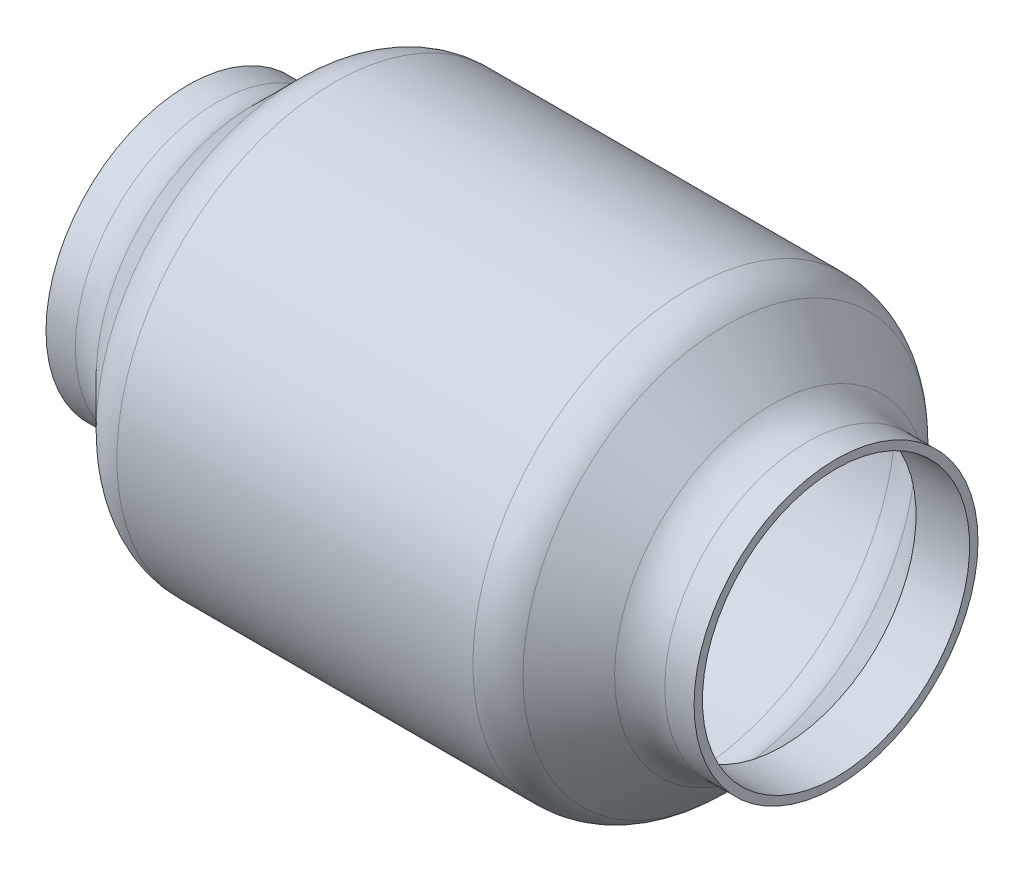
ISO-10303-21;
HEADER;
FILE_DESCRIPTION(('STEP AP214'),'2;1');
FILE_NAME('part.step','',(''),(''),'','','');
FILE_SCHEMA(('AUTOMOTIVE_DESIGN { 1 0 10303 214 1 1 1 1 }'));
ENDSEC;
DATA;
#1=APPLICATION_CONTEXT('core data for automotive mechanical design processes');
#2=APPLICATION_PROTOCOL_DEFINITION('international standard','automotive_design',2000,#1);
#3=PRODUCT_CONTEXT('',#1,'mechanical');
#4=PRODUCT('Part','Part','',(#3));
#5=PRODUCT_RELATED_PRODUCT_CATEGORY('part','',(#4));
#6=PRODUCT_DEFINITION_FORMATION('','',#4);
#7=PRODUCT_DEFINITION_CONTEXT('part definition',#1,'design');
#8=PRODUCT_DEFINITION('design','',#6,#7);
#9=PRODUCT_DEFINITION_SHAPE('','',#8);
#10=(LENGTH_UNIT() NAMED_UNIT(*) SI_UNIT(.MILLI.,.METRE.));
#11=(NAMED_UNIT(*) PLANE_ANGLE_UNIT() SI_UNIT($,.RADIAN.));
#12=(NAMED_UNIT(*) SI_UNIT($,.STERADIAN.) SOLID_ANGLE_UNIT());
#13=UNCERTAINTY_MEASURE_WITH_UNIT(LENGTH_MEASURE(1.E-05),#10,'distance_accuracy_value','');
#14=(GEOMETRIC_REPRESENTATION_CONTEXT(3) GLOBAL_UNCERTAINTY_ASSIGNED_CONTEXT((#13)) GLOBAL_UNIT_ASSIGNED_CONTEXT((#10,
#11,#12)) REPRESENTATION_CONTEXT('',''));
#15=CARTESIAN_POINT('',(0.,0.,0.));
#16=DIRECTION('',(0.,0.,1.));
#17=DIRECTION('',(1.,0.,0.));
#18=AXIS2_PLACEMENT_3D('',#15,#16,#17);
#19=CARTESIAN_POINT('',(-123.19,0.,0.));
#20=DIRECTION('',(-1.,0.,0.));
#21=DIRECTION('',(0.,-1.,0.));
#22=AXIS2_PLACEMENT_3D('',#19,#20,#21);
#23=CYLINDRICAL_SURFACE('',#22,50.8);
#24=CARTESIAN_POINT('',(-102.824871939465,0.,0.));
#25=DIRECTION('',(-1.,0.,0.));
#26=DIRECTION('',(0.,-1.,0.));
#27=AXIS2_PLACEMENT_3D('',#24,#25,#26);
#28=CIRCLE('',#27,50.8);
#29=CARTESIAN_POINT('',(-102.824871939465,-50.8,0.));
#30=VERTEX_POINT('',#29);
#31=EDGE_CURVE('E10',#30,#30,#28,.T.);
#32=ORIENTED_EDGE('',*,*,#31,.F.);
#33=EDGE_LOOP('',(#32));
#34=FACE_BOUND('',#33,.T.);
#35=CARTESIAN_POINT('',(-123.19,0.,0.));
#36=DIRECTION('',(-1.,0.,0.));
#37=DIRECTION('',(0.,-1.,0.));
#38=AXIS2_PLACEMENT_3D('',#35,#36,#37);
#39=CIRCLE('',#38,50.8);
#40=CARTESIAN_POINT('',(-123.19,-50.8,0.));
#41=VERTEX_POINT('',#40);
#42=EDGE_CURVE('E91',#41,#41,#39,.T.);
#43=ORIENTED_EDGE('',*,*,#42,.T.);
#44=EDGE_LOOP('',(#43));
#45=FACE_BOUND('',#44,.T.);
#46=ADVANCED_FACE('F33',(#34,#45),#23,.F.);
#47=CARTESIAN_POINT('',(-102.824871939465,0.,0.));
#48=DIRECTION('',(1.,0.,0.));
#49=DIRECTION('',(0.,1.,0.));
#50=AXIS2_PLACEMENT_3D('',#47,#48,#49);
#51=CONICAL_SURFACE('',#50,50.8,0.78539816339745);
#52=CARTESIAN_POINT('',(-79.8294877578618,0.,0.));
#53=DIRECTION('',(-1.,0.,0.));
#54=DIRECTION('',(0.,-1.,0.));
#55=AXIS2_PLACEMENT_3D('',#52,#53,#54);
#56=CIRCLE('',#55,73.7953841816037);
#57=CARTESIAN_POINT('',(-79.8294877578618,-73.7953841816037,0.));
#58=VERTEX_POINT('',#57);
#59=EDGE_CURVE('E39',#58,#58,#56,.T.);
#60=ORIENTED_EDGE('',*,*,#59,.F.);
#61=EDGE_LOOP('',(#60));
#62=FACE_BOUND('',#61,.T.);
#63=ORIENTED_EDGE('',*,*,#31,.T.);
#64=EDGE_LOOP('',(#63));
#65=FACE_BOUND('',#64,.T.);
#66=ADVANCED_FACE('F188',(#62,#65),#51,.F.);
#67=CARTESIAN_POINT('',(-66.3591035762581,0.,0.));
#68=DIRECTION('',(-1.,0.,0.));
#69=DIRECTION('',(0.,-1.,0.));
#70=AXIS2_PLACEMENT_3D('',#67,#68,#69);
#71=TOROIDAL_SURFACE('',#70,60.325,19.05);
#72=CARTESIAN_POINT('',(-66.3591035762581,0.,0.));
#73=DIRECTION('',(-1.,0.,0.));
#74=DIRECTION('',(0.,-1.,0.));
#75=AXIS2_PLACEMENT_3D('',#72,#73,#74);
#76=CIRCLE('',#75,79.375);
#77=CARTESIAN_POINT('',(-66.359103576258,-79.375,0.));
#78=VERTEX_POINT('',#77);
#79=EDGE_CURVE('E43',#78,#78,#76,.T.);
#80=ORIENTED_EDGE('',*,*,#79,.F.);
#81=EDGE_LOOP('',(#80));
#82=FACE_BOUND('',#81,.T.);
#83=ORIENTED_EDGE('',*,*,#59,.T.);
#84=EDGE_LOOP('',(#83));
#85=FACE_BOUND('',#84,.T.);
#86=ADVANCED_FACE('F183',(#82,#85),#71,.F.);
#87=CARTESIAN_POINT('',(-123.19,0.,0.));
#88=DIRECTION('',(-1.,0.,0.));
#89=DIRECTION('',(0.,-1.,0.));
#90=AXIS2_PLACEMENT_3D('',#87,#88,#89);
#91=CYLINDRICAL_SURFACE('',#90,79.375);
#92=CARTESIAN_POINT('',(66.3591035762581,0.,0.));
#93=DIRECTION('',(-1.,0.,0.));
#94=DIRECTION('',(0.,-1.,0.));
#95=AXIS2_PLACEMENT_3D('',#92,#93,#94);
#96=CIRCLE('',#95,79.3749999999999);
#97=CARTESIAN_POINT('',(66.3591035762581,-79.3749999999999,0.));
#98=VERTEX_POINT('',#97);
#99=EDGE_CURVE('E47',#98,#98,#96,.T.);
#100=ORIENTED_EDGE('',*,*,#99,.F.);
#101=EDGE_LOOP('',(#100));
#102=FACE_BOUND('',#101,.T.);
#103=ORIENTED_EDGE('',*,*,#79,.T.);
#104=EDGE_LOOP('',(#103));
#105=FACE_BOUND('',#104,.T.);
#106=ADVANCED_FACE('F177',(#102,#105),#91,.F.);
#107=CARTESIAN_POINT('',(66.3591035762581,0.,0.));
#108=DIRECTION('',(-1.,0.,0.));
#109=DIRECTION('',(0.,-1.,0.));
#110=AXIS2_PLACEMENT_3D('',#107,#108,#109);
#111=TOROIDAL_SURFACE('',#110,60.3249999999999,19.05);
#112=CARTESIAN_POINT('',(79.8294877578618,0.,0.));
#113=DIRECTION('',(-1.,0.,0.));
#114=DIRECTION('',(0.,-1.,0.));
#115=AXIS2_PLACEMENT_3D('',#112,#113,#114);
#116=CIRCLE('',#115,73.7953841816036);
#117=CARTESIAN_POINT('',(79.8294877578618,-73.7953841816036,0.));
#118=VERTEX_POINT('',#117);
#119=EDGE_CURVE('E52',#118,#118,#116,.T.);
#120=ORIENTED_EDGE('',*,*,#119,.F.);
#121=EDGE_LOOP('',(#120));
#122=FACE_BOUND('',#121,.T.);
#123=ORIENTED_EDGE('',*,*,#99,.T.);
#124=EDGE_LOOP('',(#123));
#125=FACE_BOUND('',#124,.T.);
#126=ADVANCED_FACE('F171',(#122,#125),#111,.F.);
#127=CARTESIAN_POINT('',(79.8294877578618,0.,0.));
#128=DIRECTION('',(-1.,0.,0.));
#129=DIRECTION('',(0.,-1.,0.));
#130=AXIS2_PLACEMENT_3D('',#127,#128,#129);
#131=CONICAL_SURFACE('',#130,73.7953841816036,0.78539816339745);
#132=CARTESIAN_POINT('',(102.824871939465,0.,0.));
#133=DIRECTION('',(-1.,0.,0.));
#134=DIRECTION('',(0.,-1.,0.));
#135=AXIS2_PLACEMENT_3D('',#132,#133,#134);
#136=CIRCLE('',#135,50.7999999999999);
#137=CARTESIAN_POINT('',(102.824871939465,-50.7999999999999,0.));
#138=VERTEX_POINT('',#137);
#139=EDGE_CURVE('E55',#138,#138,#136,.T.);
#140=ORIENTED_EDGE('',*,*,#139,.F.);
#141=EDGE_LOOP('',(#140));
#142=FACE_BOUND('',#141,.T.);
#143=ORIENTED_EDGE('',*,*,#119,.T.);
#144=EDGE_LOOP('',(#143));
#145=FACE_BOUND('',#144,.T.);
#146=ADVANCED_FACE('F165',(#142,#145),#131,.F.);
#147=CARTESIAN_POINT('',(-123.19,0.,0.));
#148=DIRECTION('',(-1.,0.,0.));
#149=DIRECTION('',(0.,-1.,0.));
#150=AXIS2_PLACEMENT_3D('',#147,#148,#149);
#151=CYLINDRICAL_SURFACE('',#150,50.7999999999999);
#152=CARTESIAN_POINT('',(123.19,0.,0.));
#153=DIRECTION('',(-1.,0.,0.));
#154=DIRECTION('',(0.,-1.,0.));
#155=AXIS2_PLACEMENT_3D('',#152,#153,#154);
#156=CIRCLE('',#155,50.7999999999999);
#157=CARTESIAN_POINT('',(123.19,-50.7999999999999,0.));
#158=VERTEX_POINT('',#157);
#159=EDGE_CURVE('E58',#158,#158,#156,.T.);
#160=ORIENTED_EDGE('',*,*,#159,.F.);
#161=EDGE_LOOP('',(#160));
#162=FACE_BOUND('',#161,.T.);
#163=ORIENTED_EDGE('',*,*,#139,.T.);
#164=EDGE_LOOP('',(#163));
#165=FACE_BOUND('',#164,.T.);
#166=ADVANCED_FACE('F159',(#162,#165),#151,.F.);
#167=CARTESIAN_POINT('',(123.19,50.8,0.));
#168=DIRECTION('',(-1.,0.,0.));
#169=DIRECTION('',(0.,-1.,0.));
#170=AXIS2_PLACEMENT_3D('',#167,#168,#169);
#171=PLANE('',#170);
#172=CARTESIAN_POINT('',(123.19,0.,0.));
#173=DIRECTION('',(-1.,0.,0.));
#174=DIRECTION('',(0.,-1.,0.));
#175=AXIS2_PLACEMENT_3D('',#172,#173,#174);
#176=CIRCLE('',#175,53.9749999999999);
#177=CARTESIAN_POINT('',(123.19,-53.9749999999999,0.));
#178=VERTEX_POINT('',#177);
#179=EDGE_CURVE('E61',#178,#178,#176,.T.);
#180=ORIENTED_EDGE('',*,*,#179,.F.);
#181=EDGE_LOOP('',(#180));
#182=FACE_BOUND('',#181,.T.);
#183=ORIENTED_EDGE('',*,*,#159,.T.);
#184=EDGE_LOOP('',(#183));
#185=FACE_BOUND('',#184,.T.);
#186=ADVANCED_FACE('F153',(#182,#185),#171,.F.);
#187=CARTESIAN_POINT('',(-123.19,0.,0.));
#188=DIRECTION('',(-1.,0.,0.));
#189=DIRECTION('',(0.,-1.,0.));
#190=AXIS2_PLACEMENT_3D('',#187,#188,#189);
#191=CYLINDRICAL_SURFACE('',#190,53.975);
#192=CARTESIAN_POINT('',(112.030768363207,0.,0.));
#193=DIRECTION('',(-1.,0.,0.));
#194=DIRECTION('',(0.,-1.,0.));
#195=AXIS2_PLACEMENT_3D('',#192,#193,#194);
#196=CIRCLE('',#195,53.975);
#197=CARTESIAN_POINT('',(112.030768363207,-53.9749999999999,0.));
#198=VERTEX_POINT('',#197);
#199=EDGE_CURVE('E64',#198,#198,#196,.T.);
#200=ORIENTED_EDGE('',*,*,#199,.F.);
#201=EDGE_LOOP('',(#200));
#202=FACE_BOUND('',#201,.T.);
#203=ORIENTED_EDGE('',*,*,#179,.T.);
#204=EDGE_LOOP('',(#203));
#205=FACE_BOUND('',#204,.T.);
#206=ADVANCED_FACE('F147',(#202,#205),#191,.T.);
#207=CARTESIAN_POINT('',(112.030768363207,0.,0.));
#208=DIRECTION('',(-1.,0.,0.));
#209=DIRECTION('',(0.,-1.,0.));
#210=AXIS2_PLACEMENT_3D('',#207,#208,#209);
#211=TOROIDAL_SURFACE('',#210,73.0249999999999,19.05);
#212=CARTESIAN_POINT('',(98.5603841816037,0.,0.));
#213=DIRECTION('',(-1.,0.,0.));
#214=DIRECTION('',(0.,-1.,0.));
#215=AXIS2_PLACEMENT_3D('',#212,#213,#214);
#216=CIRCLE('',#215,59.5546158183963);
#217=CARTESIAN_POINT('',(98.5603841816037,-59.5546158183962,0.));
#218=VERTEX_POINT('',#217);
#219=EDGE_CURVE('E67',#218,#218,#216,.T.);
#220=ORIENTED_EDGE('',*,*,#219,.F.);
#221=EDGE_LOOP('',(#220));
#222=FACE_BOUND('',#221,.T.);
#223=ORIENTED_EDGE('',*,*,#199,.T.);
#224=EDGE_LOOP('',(#223));
#225=FACE_BOUND('',#224,.T.);
#226=ADVANCED_FACE('F141',(#222,#225),#211,.F.);
#227=CARTESIAN_POINT('',(98.5603841816037,0.,0.));
#228=DIRECTION('',(-1.,0.,0.));
#229=DIRECTION('',(0.,-1.,0.));
#230=AXIS2_PLACEMENT_3D('',#227,#228,#229);
#231=CONICAL_SURFACE('',#230,59.5546158183963,0.78539816339745);
#232=CARTESIAN_POINT('',(81.1446158183964,0.,0.));
#233=DIRECTION('',(-1.,0.,0.));
#234=DIRECTION('',(0.,-1.,0.));
#235=AXIS2_PLACEMENT_3D('',#232,#233,#234);
#236=CIRCLE('',#235,76.9703841816036);
#237=CARTESIAN_POINT('',(81.1446158183964,-76.9703841816036,0.));
#238=VERTEX_POINT('',#237);
#239=EDGE_CURVE('E70',#238,#238,#236,.T.);
#240=ORIENTED_EDGE('',*,*,#239,.F.);
#241=EDGE_LOOP('',(#240));
#242=FACE_BOUND('',#241,.T.);
#243=ORIENTED_EDGE('',*,*,#219,.T.);
#244=EDGE_LOOP('',(#243));
#245=FACE_BOUND('',#244,.T.);
#246=ADVANCED_FACE('F135',(#242,#245),#231,.T.);
#247=CARTESIAN_POINT('',(67.6742316367926,0.,0.));
#248=DIRECTION('',(-1.,0.,0.));
#249=DIRECTION('',(0.,-1.,0.));
#250=AXIS2_PLACEMENT_3D('',#247,#248,#249);
#251=TOROIDAL_SURFACE('',#250,63.4999999999999,19.05);
#252=CARTESIAN_POINT('',(67.6742316367926,0.,0.));
#253=DIRECTION('',(-1.,0.,0.));
#254=DIRECTION('',(0.,-1.,0.));
#255=AXIS2_PLACEMENT_3D('',#252,#253,#254);
#256=CIRCLE('',#255,82.5499999999999);
#257=CARTESIAN_POINT('',(67.6742316367926,-82.5499999999999,0.));
#258=VERTEX_POINT('',#257);
#259=EDGE_CURVE('E73',#258,#258,#256,.T.);
#260=ORIENTED_EDGE('',*,*,#259,.F.);
#261=EDGE_LOOP('',(#260));
#262=FACE_BOUND('',#261,.T.);
#263=ORIENTED_EDGE('',*,*,#239,.T.);
#264=EDGE_LOOP('',(#263));
#265=FACE_BOUND('',#264,.T.);
#266=ADVANCED_FACE('F129',(#262,#265),#251,.T.);
#267=CARTESIAN_POINT('',(-123.19,0.,0.));
#268=DIRECTION('',(-1.,0.,0.));
#269=DIRECTION('',(0.,-1.,0.));
#270=AXIS2_PLACEMENT_3D('',#267,#268,#269);
#271=CYLINDRICAL_SURFACE('',#270,82.55);
#272=CARTESIAN_POINT('',(-67.6742316367927,0.,0.));
#273=DIRECTION('',(-1.,0.,0.));
#274=DIRECTION('',(0.,-1.,0.));
#275=AXIS2_PLACEMENT_3D('',#272,#273,#274);
#276=CIRCLE('',#275,82.55);
#277=CARTESIAN_POINT('',(-67.6742316367927,-82.55,0.));
#278=VERTEX_POINT('',#277);
#279=EDGE_CURVE('E76',#278,#278,#276,.T.);
#280=ORIENTED_EDGE('',*,*,#279,.F.);
#281=EDGE_LOOP('',(#280));
#282=FACE_BOUND('',#281,.T.);
#283=ORIENTED_EDGE('',*,*,#259,.T.);
#284=EDGE_LOOP('',(#283));
#285=FACE_BOUND('',#284,.T.);
#286=ADVANCED_FACE('F123',(#282,#285),#271,.T.);
#287=CARTESIAN_POINT('',(-67.6742316367927,0.,0.));
#288=DIRECTION('',(-1.,0.,0.));
#289=DIRECTION('',(0.,-1.,0.));
#290=AXIS2_PLACEMENT_3D('',#287,#288,#289);
#291=TOROIDAL_SURFACE('',#290,63.5,19.05);
#292=CARTESIAN_POINT('',(-81.1446158183964,0.,0.));
#293=DIRECTION('',(-1.,0.,0.));
#294=DIRECTION('',(0.,-1.,0.));
#295=AXIS2_PLACEMENT_3D('',#292,#293,#294);
#296=CIRCLE('',#295,76.9703841816036);
#297=CARTESIAN_POINT('',(-81.1446158183964,-76.9703841816036,0.));
#298=VERTEX_POINT('',#297);
#299=EDGE_CURVE('E79',#298,#298,#296,.T.);
#300=ORIENTED_EDGE('',*,*,#299,.F.);
#301=EDGE_LOOP('',(#300));
#302=FACE_BOUND('',#301,.T.);
#303=ORIENTED_EDGE('',*,*,#279,.T.);
#304=EDGE_LOOP('',(#303));
#305=FACE_BOUND('',#304,.T.);
#306=ADVANCED_FACE('F117',(#302,#305),#291,.T.);
#307=CARTESIAN_POINT('',(-81.1446158183964,0.,0.));
#308=DIRECTION('',(1.,0.,0.));
#309=DIRECTION('',(0.,1.,0.));
#310=AXIS2_PLACEMENT_3D('',#307,#308,#309);
#311=CONICAL_SURFACE('',#310,76.9703841816036,0.785398163397449);
#312=CARTESIAN_POINT('',(-98.5603841816038,0.,0.));
#313=DIRECTION('',(-1.,0.,0.));
#314=DIRECTION('',(0.,-1.,0.));
#315=AXIS2_PLACEMENT_3D('',#312,#313,#314);
#316=CIRCLE('',#315,59.5546158183963);
#317=CARTESIAN_POINT('',(-98.5603841816037,-59.5546158183963,0.));
#318=VERTEX_POINT('',#317);
#319=EDGE_CURVE('E82',#318,#318,#316,.T.);
#320=ORIENTED_EDGE('',*,*,#319,.F.);
#321=EDGE_LOOP('',(#320));
#322=FACE_BOUND('',#321,.T.);
#323=ORIENTED_EDGE('',*,*,#299,.T.);
#324=EDGE_LOOP('',(#323));
#325=FACE_BOUND('',#324,.T.);
#326=ADVANCED_FACE('F111',(#322,#325),#311,.T.);
#327=CARTESIAN_POINT('',(-112.030768363207,0.,0.));
#328=DIRECTION('',(-1.,0.,0.));
#329=DIRECTION('',(0.,-1.,0.));
#330=AXIS2_PLACEMENT_3D('',#327,#328,#329);
#331=TOROIDAL_SURFACE('',#330,73.025,19.05);
#332=CARTESIAN_POINT('',(-112.030768363207,0.,0.));
#333=DIRECTION('',(-1.,0.,0.));
#334=DIRECTION('',(0.,-1.,0.));
#335=AXIS2_PLACEMENT_3D('',#332,#333,#334);
#336=CIRCLE('',#335,53.975);
#337=CARTESIAN_POINT('',(-112.030768363207,-53.975,0.));
#338=VERTEX_POINT('',#337);
#339=EDGE_CURVE('E85',#338,#338,#336,.T.);
#340=ORIENTED_EDGE('',*,*,#339,.F.);
#341=EDGE_LOOP('',(#340));
#342=FACE_BOUND('',#341,.T.);
#343=ORIENTED_EDGE('',*,*,#319,.T.);
#344=EDGE_LOOP('',(#343));
#345=FACE_BOUND('',#344,.T.);
#346=ADVANCED_FACE('F105',(#342,#345),#331,.F.);
#347=CARTESIAN_POINT('',(-123.19,0.,0.));
#348=DIRECTION('',(-1.,0.,0.));
#349=DIRECTION('',(0.,-1.,0.));
#350=AXIS2_PLACEMENT_3D('',#347,#348,#349);
#351=CYLINDRICAL_SURFACE('',#350,53.975);
#352=CARTESIAN_POINT('',(-123.19,0.,0.));
#353=DIRECTION('',(-1.,0.,0.));
#354=DIRECTION('',(0.,-1.,0.));
#355=AXIS2_PLACEMENT_3D('',#352,#353,#354);
#356=CIRCLE('',#355,53.975);
#357=CARTESIAN_POINT('',(-123.19,-53.975,0.));
#358=VERTEX_POINT('',#357);
#359=EDGE_CURVE('E88',#358,#358,#356,.T.);
#360=ORIENTED_EDGE('',*,*,#359,.F.);
#361=EDGE_LOOP('',(#360));
#362=FACE_BOUND('',#361,.T.);
#363=ORIENTED_EDGE('',*,*,#339,.T.);
#364=EDGE_LOOP('',(#363));
#365=FACE_BOUND('',#364,.T.);
#366=ADVANCED_FACE('F99',(#362,#365),#351,.T.);
#367=CARTESIAN_POINT('',(-123.19,53.975,0.));
#368=DIRECTION('',(1.,0.,0.));
#369=DIRECTION('',(0.,1.,0.));
#370=AXIS2_PLACEMENT_3D('',#367,#368,#369);
#371=PLANE('',#370);
#372=ORIENTED_EDGE('',*,*,#42,.F.);
#373=EDGE_LOOP('',(#372));
#374=FACE_BOUND('',#373,.T.);
#375=ORIENTED_EDGE('',*,*,#359,.T.);
#376=EDGE_LOOP('',(#375));
#377=FACE_BOUND('',#376,.T.);
#378=ADVANCED_FACE('F96',(#374,#377),#371,.F.);
#379=CLOSED_SHELL('',(#46,#66,#86,#106,#126,#146,#166,#186,#206,#226,#246,#266,#286,#306,#326,
#346,#366,#378));
#380=MANIFOLD_SOLID_BREP('B2',#379);
#381=ADVANCED_BREP_SHAPE_REPRESENTATION('',(#18,#380),#14);
#382=SHAPE_DEFINITION_REPRESENTATION(#9,#381);
ENDSEC;
END-ISO-10303-21;
